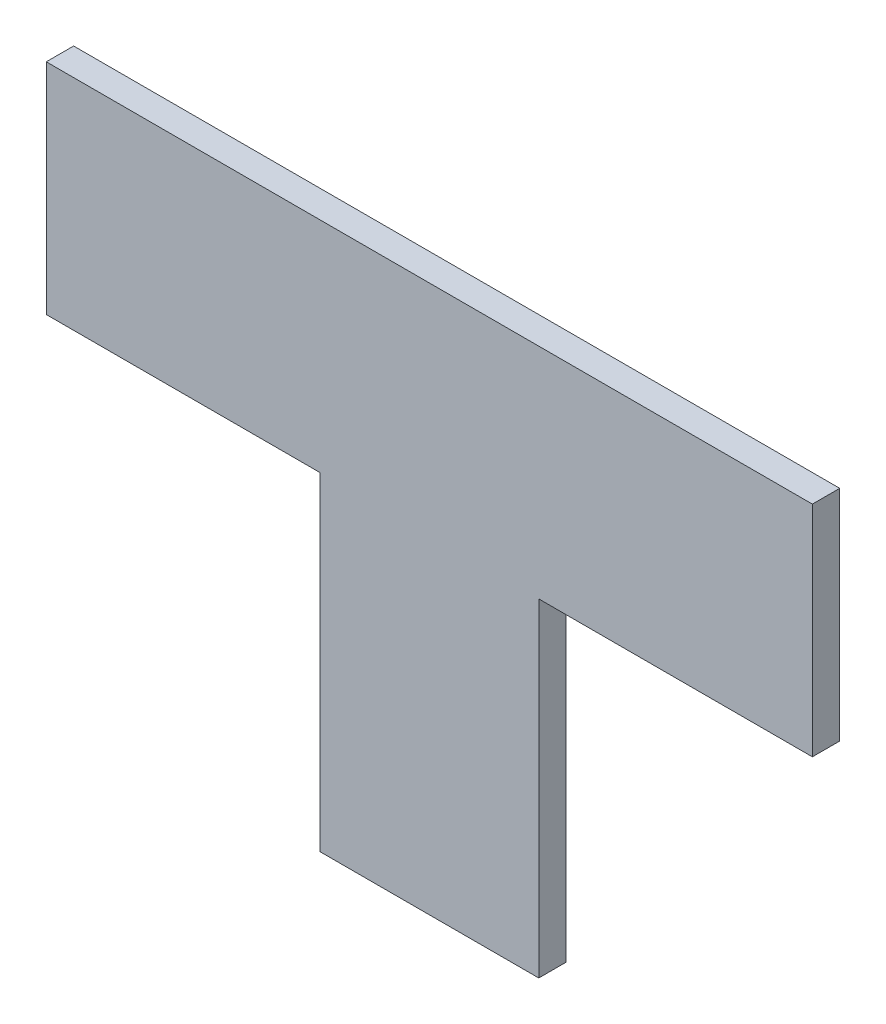
ISO-10303-21;
HEADER;
FILE_DESCRIPTION(('STEP AP214'),'2;1');
FILE_NAME('part.step','',(''),(''),'','','');
FILE_SCHEMA(('AUTOMOTIVE_DESIGN { 1 0 10303 214 1 1 1 1 }'));
ENDSEC;
DATA;
#1=APPLICATION_CONTEXT('core data for automotive mechanical design processes');
#2=APPLICATION_PROTOCOL_DEFINITION('international standard','automotive_design',2000,#1);
#3=PRODUCT_CONTEXT('',#1,'mechanical');
#4=PRODUCT('Part','Part','',(#3));
#5=PRODUCT_RELATED_PRODUCT_CATEGORY('part','',(#4));
#6=PRODUCT_DEFINITION_FORMATION('','',#4);
#7=PRODUCT_DEFINITION_CONTEXT('part definition',#1,'design');
#8=PRODUCT_DEFINITION('design','',#6,#7);
#9=PRODUCT_DEFINITION_SHAPE('','',#8);
#10=(LENGTH_UNIT() NAMED_UNIT(*) SI_UNIT(.MILLI.,.METRE.));
#11=(NAMED_UNIT(*) PLANE_ANGLE_UNIT() SI_UNIT($,.RADIAN.));
#12=(NAMED_UNIT(*) SI_UNIT($,.STERADIAN.) SOLID_ANGLE_UNIT());
#13=UNCERTAINTY_MEASURE_WITH_UNIT(LENGTH_MEASURE(1.E-05),#10,'distance_accuracy_value','');
#14=(GEOMETRIC_REPRESENTATION_CONTEXT(3) GLOBAL_UNCERTAINTY_ASSIGNED_CONTEXT((#13)) GLOBAL_UNIT_ASSIGNED_CONTEXT((#10,
#11,#12)) REPRESENTATION_CONTEXT('',''));
#15=CARTESIAN_POINT('',(0.,0.,0.));
#16=DIRECTION('',(0.,0.,1.));
#17=DIRECTION('',(1.,0.,0.));
#18=AXIS2_PLACEMENT_3D('',#15,#16,#17);
#19=CARTESIAN_POINT('',(25.4,0.,3.175));
#20=DIRECTION('',(0.,1.,0.));
#21=DIRECTION('',(0.,0.,1.));
#22=AXIS2_PLACEMENT_3D('',#19,#20,#21);
#23=PLANE('',#22);
#24=DIRECTION('',(1.,0.,0.));
#25=VECTOR('',#24,1.);
#26=CARTESIAN_POINT('',(25.4,0.,0.));
#27=LINE('',#26,#25);
#28=CARTESIAN_POINT('',(0.,0.,0.));
#29=VERTEX_POINT('',#28);
#30=CARTESIAN_POINT('',(25.4,0.,0.));
#31=VERTEX_POINT('',#30);
#32=EDGE_CURVE('E144',#29,#31,#27,.T.);
#33=ORIENTED_EDGE('',*,*,#32,.T.);
#34=DIRECTION('',(0.,0.,-1.));
#35=VECTOR('',#34,1.);
#36=CARTESIAN_POINT('',(25.4,0.,3.175));
#37=LINE('',#36,#35);
#38=CARTESIAN_POINT('',(25.4,0.,3.175));
#39=VERTEX_POINT('',#38);
#40=EDGE_CURVE('E11',#39,#31,#37,.T.);
#41=ORIENTED_EDGE('',*,*,#40,.F.);
#42=DIRECTION('',(1.,0.,0.));
#43=VECTOR('',#42,1.);
#44=CARTESIAN_POINT('',(25.4,0.,3.175));
#45=LINE('',#44,#43);
#46=CARTESIAN_POINT('',(0.,0.,3.175));
#47=VERTEX_POINT('',#46);
#48=EDGE_CURVE('E166',#47,#39,#45,.T.);
#49=ORIENTED_EDGE('',*,*,#48,.F.);
#50=DIRECTION('',(0.,0.,-1.));
#51=VECTOR('',#50,1.);
#52=CARTESIAN_POINT('',(0.,0.,3.175));
#53=LINE('',#52,#51);
#54=EDGE_CURVE('E140',#47,#29,#53,.T.);
#55=ORIENTED_EDGE('',*,*,#54,.T.);
#56=EDGE_LOOP('',(#33,#41,#49,#55));
#57=FACE_BOUND('',#56,.T.);
#58=ADVANCED_FACE('F43',(#57),#23,.F.);
#59=CARTESIAN_POINT('',(25.4,38.1,3.175));
#60=DIRECTION('',(-1.,0.,0.));
#61=DIRECTION('',(0.,-1.,0.));
#62=AXIS2_PLACEMENT_3D('',#59,#60,#61);
#63=PLANE('',#62);
#64=DIRECTION('',(0.,1.,0.));
#65=VECTOR('',#64,1.);
#66=CARTESIAN_POINT('',(25.4,38.1,0.));
#67=LINE('',#66,#65);
#68=CARTESIAN_POINT('',(25.4,38.1,0.));
#69=VERTEX_POINT('',#68);
#70=EDGE_CURVE('E148',#31,#69,#67,.T.);
#71=ORIENTED_EDGE('',*,*,#70,.T.);
#72=DIRECTION('',(0.,0.,-1.));
#73=VECTOR('',#72,1.);
#74=CARTESIAN_POINT('',(25.4,38.1,3.175));
#75=LINE('',#74,#73);
#76=CARTESIAN_POINT('',(25.4,38.1,3.175));
#77=VERTEX_POINT('',#76);
#78=EDGE_CURVE('E52',#77,#69,#75,.T.);
#79=ORIENTED_EDGE('',*,*,#78,.F.);
#80=DIRECTION('',(0.,1.,0.));
#81=VECTOR('',#80,1.);
#82=CARTESIAN_POINT('',(25.4,38.1,3.175));
#83=LINE('',#82,#81);
#84=EDGE_CURVE('E103',#39,#77,#83,.T.);
#85=ORIENTED_EDGE('',*,*,#84,.F.);
#86=ORIENTED_EDGE('',*,*,#40,.T.);
#87=EDGE_LOOP('',(#71,#79,#85,#86));
#88=FACE_BOUND('',#87,.T.);
#89=ADVANCED_FACE('F212',(#88),#63,.F.);
#90=CARTESIAN_POINT('',(57.15,38.1,3.175));
#91=DIRECTION('',(0.,1.,0.));
#92=DIRECTION('',(-1.,0.,0.));
#93=AXIS2_PLACEMENT_3D('',#90,#91,#92);
#94=PLANE('',#93);
#95=DIRECTION('',(1.,0.,0.));
#96=VECTOR('',#95,1.);
#97=CARTESIAN_POINT('',(57.15,38.1,0.));
#98=LINE('',#97,#96);
#99=CARTESIAN_POINT('',(57.15,38.1,0.));
#100=VERTEX_POINT('',#99);
#101=EDGE_CURVE('E151',#69,#100,#98,.T.);
#102=ORIENTED_EDGE('',*,*,#101,.T.);
#103=DIRECTION('',(0.,0.,-1.));
#104=VECTOR('',#103,1.);
#105=CARTESIAN_POINT('',(57.15,38.1,3.175));
#106=LINE('',#105,#104);
#107=CARTESIAN_POINT('',(57.15,38.1,3.175));
#108=VERTEX_POINT('',#107);
#109=EDGE_CURVE('E177',#108,#100,#106,.T.);
#110=ORIENTED_EDGE('',*,*,#109,.F.);
#111=DIRECTION('',(1.,0.,0.));
#112=VECTOR('',#111,1.);
#113=CARTESIAN_POINT('',(57.15,38.1,3.175));
#114=LINE('',#113,#112);
#115=EDGE_CURVE('E187',#77,#108,#114,.T.);
#116=ORIENTED_EDGE('',*,*,#115,.F.);
#117=ORIENTED_EDGE('',*,*,#78,.T.);
#118=EDGE_LOOP('',(#102,#110,#116,#117));
#119=FACE_BOUND('',#118,.T.);
#120=ADVANCED_FACE('F185',(#119),#94,.F.);
#121=CARTESIAN_POINT('',(57.15,63.5,3.175));
#122=DIRECTION('',(-1.,0.,0.));
#123=DIRECTION('',(0.,-1.,0.));
#124=AXIS2_PLACEMENT_3D('',#121,#122,#123);
#125=PLANE('',#124);
#126=DIRECTION('',(0.,1.,0.));
#127=VECTOR('',#126,1.);
#128=CARTESIAN_POINT('',(57.15,63.5,0.));
#129=LINE('',#128,#127);
#130=CARTESIAN_POINT('',(57.15,63.5,0.));
#131=VERTEX_POINT('',#130);
#132=EDGE_CURVE('E154',#100,#131,#129,.T.);
#133=ORIENTED_EDGE('',*,*,#132,.T.);
#134=DIRECTION('',(0.,0.,-1.));
#135=VECTOR('',#134,1.);
#136=CARTESIAN_POINT('',(57.15,63.5,3.175));
#137=LINE('',#136,#135);
#138=CARTESIAN_POINT('',(57.15,63.5,3.175));
#139=VERTEX_POINT('',#138);
#140=EDGE_CURVE('E173',#139,#131,#137,.T.);
#141=ORIENTED_EDGE('',*,*,#140,.F.);
#142=DIRECTION('',(0.,1.,0.));
#143=VECTOR('',#142,1.);
#144=CARTESIAN_POINT('',(57.15,63.5,3.175));
#145=LINE('',#144,#143);
#146=EDGE_CURVE('E200',#108,#139,#145,.T.);
#147=ORIENTED_EDGE('',*,*,#146,.F.);
#148=ORIENTED_EDGE('',*,*,#109,.T.);
#149=EDGE_LOOP('',(#133,#141,#147,#148));
#150=FACE_BOUND('',#149,.T.);
#151=ADVANCED_FACE('F195',(#150),#125,.F.);
#152=CARTESIAN_POINT('',(-31.75,63.5,3.175));
#153=DIRECTION('',(0.,-1.,0.));
#154=DIRECTION('',(1.,0.,0.));
#155=AXIS2_PLACEMENT_3D('',#152,#153,#154);
#156=PLANE('',#155);
#157=DIRECTION('',(-1.,0.,0.));
#158=VECTOR('',#157,1.);
#159=CARTESIAN_POINT('',(-31.75,63.5,0.));
#160=LINE('',#159,#158);
#161=CARTESIAN_POINT('',(-31.75,63.5,0.));
#162=VERTEX_POINT('',#161);
#163=EDGE_CURVE('E157',#131,#162,#160,.T.);
#164=ORIENTED_EDGE('',*,*,#163,.T.);
#165=DIRECTION('',(0.,0.,-1.));
#166=VECTOR('',#165,1.);
#167=CARTESIAN_POINT('',(-31.75,63.5,3.175));
#168=LINE('',#167,#166);
#169=CARTESIAN_POINT('',(-31.75,63.5,3.175));
#170=VERTEX_POINT('',#169);
#171=EDGE_CURVE('E133',#170,#162,#168,.T.);
#172=ORIENTED_EDGE('',*,*,#171,.F.);
#173=DIRECTION('',(-1.,0.,0.));
#174=VECTOR('',#173,1.);
#175=CARTESIAN_POINT('',(-31.75,63.5,3.175));
#176=LINE('',#175,#174);
#177=EDGE_CURVE('E122',#139,#170,#176,.T.);
#178=ORIENTED_EDGE('',*,*,#177,.F.);
#179=ORIENTED_EDGE('',*,*,#140,.T.);
#180=EDGE_LOOP('',(#164,#172,#178,#179));
#181=FACE_BOUND('',#180,.T.);
#182=ADVANCED_FACE('F198',(#181),#156,.F.);
#183=CARTESIAN_POINT('',(-31.75,38.1,3.175));
#184=DIRECTION('',(1.,0.,0.));
#185=DIRECTION('',(0.,1.,0.));
#186=AXIS2_PLACEMENT_3D('',#183,#184,#185);
#187=PLANE('',#186);
#188=DIRECTION('',(0.,-1.,0.));
#189=VECTOR('',#188,1.);
#190=CARTESIAN_POINT('',(-31.75,38.1,0.));
#191=LINE('',#190,#189);
#192=CARTESIAN_POINT('',(-31.75,38.1,0.));
#193=VERTEX_POINT('',#192);
#194=EDGE_CURVE('E131',#162,#193,#191,.T.);
#195=ORIENTED_EDGE('',*,*,#194,.T.);
#196=DIRECTION('',(0.,0.,-1.));
#197=VECTOR('',#196,1.);
#198=CARTESIAN_POINT('',(-31.75,38.1,3.175));
#199=LINE('',#198,#197);
#200=CARTESIAN_POINT('',(-31.75,38.1,3.175));
#201=VERTEX_POINT('',#200);
#202=EDGE_CURVE('E128',#201,#193,#199,.T.);
#203=ORIENTED_EDGE('',*,*,#202,.F.);
#204=DIRECTION('',(0.,-1.,0.));
#205=VECTOR('',#204,1.);
#206=CARTESIAN_POINT('',(-31.75,38.1,3.175));
#207=LINE('',#206,#205);
#208=EDGE_CURVE('E116',#170,#201,#207,.T.);
#209=ORIENTED_EDGE('',*,*,#208,.F.);
#210=ORIENTED_EDGE('',*,*,#171,.T.);
#211=EDGE_LOOP('',(#195,#203,#209,#210));
#212=FACE_BOUND('',#211,.T.);
#213=ADVANCED_FACE('F129',(#212),#187,.F.);
#214=CARTESIAN_POINT('',(0.,38.1,3.175));
#215=DIRECTION('',(0.,1.,0.));
#216=DIRECTION('',(-1.,0.,0.));
#217=AXIS2_PLACEMENT_3D('',#214,#215,#216);
#218=PLANE('',#217);
#219=DIRECTION('',(1.,0.,0.));
#220=VECTOR('',#219,1.);
#221=CARTESIAN_POINT('',(0.,38.1,0.));
#222=LINE('',#221,#220);
#223=CARTESIAN_POINT('',(0.,38.1,0.));
#224=VERTEX_POINT('',#223);
#225=EDGE_CURVE('E89',#193,#224,#222,.T.);
#226=ORIENTED_EDGE('',*,*,#225,.T.);
#227=DIRECTION('',(0.,0.,-1.));
#228=VECTOR('',#227,1.);
#229=CARTESIAN_POINT('',(0.,38.1,3.175));
#230=LINE('',#229,#228);
#231=CARTESIAN_POINT('',(0.,38.1,3.175));
#232=VERTEX_POINT('',#231);
#233=EDGE_CURVE('E134',#232,#224,#230,.T.);
#234=ORIENTED_EDGE('',*,*,#233,.F.);
#235=DIRECTION('',(1.,0.,0.));
#236=VECTOR('',#235,1.);
#237=CARTESIAN_POINT('',(0.,38.1,3.175));
#238=LINE('',#237,#236);
#239=EDGE_CURVE('E120',#201,#232,#238,.T.);
#240=ORIENTED_EDGE('',*,*,#239,.F.);
#241=ORIENTED_EDGE('',*,*,#202,.T.);
#242=EDGE_LOOP('',(#226,#234,#240,#241));
#243=FACE_BOUND('',#242,.T.);
#244=ADVANCED_FACE('F136',(#243),#218,.F.);
#245=CARTESIAN_POINT('',(0.,0.,3.175));
#246=DIRECTION('',(1.,0.,0.));
#247=DIRECTION('',(0.,0.,-1.));
#248=AXIS2_PLACEMENT_3D('',#245,#246,#247);
#249=PLANE('',#248);
#250=DIRECTION('',(0.,-1.,0.));
#251=VECTOR('',#250,1.);
#252=CARTESIAN_POINT('',(0.,0.,0.));
#253=LINE('',#252,#251);
#254=EDGE_CURVE('E95',#224,#29,#253,.T.);
#255=ORIENTED_EDGE('',*,*,#254,.T.);
#256=ORIENTED_EDGE('',*,*,#54,.F.);
#257=DIRECTION('',(0.,-1.,0.));
#258=VECTOR('',#257,1.);
#259=CARTESIAN_POINT('',(0.,0.,3.175));
#260=LINE('',#259,#258);
#261=EDGE_CURVE('E60',#232,#47,#260,.T.);
#262=ORIENTED_EDGE('',*,*,#261,.F.);
#263=ORIENTED_EDGE('',*,*,#233,.T.);
#264=EDGE_LOOP('',(#255,#256,#262,#263));
#265=FACE_BOUND('',#264,.T.);
#266=ADVANCED_FACE('F228',(#265),#249,.F.);
#267=CARTESIAN_POINT('',(0.,0.,3.175));
#268=DIRECTION('',(0.,0.,-1.));
#269=DIRECTION('',(-1.,0.,0.));
#270=AXIS2_PLACEMENT_3D('',#267,#268,#269);
#271=PLANE('',#270);
#272=ORIENTED_EDGE('',*,*,#48,.T.);
#273=ORIENTED_EDGE('',*,*,#84,.T.);
#274=ORIENTED_EDGE('',*,*,#115,.T.);
#275=ORIENTED_EDGE('',*,*,#146,.T.);
#276=ORIENTED_EDGE('',*,*,#177,.T.);
#277=ORIENTED_EDGE('',*,*,#208,.T.);
#278=ORIENTED_EDGE('',*,*,#239,.T.);
#279=ORIENTED_EDGE('',*,*,#261,.T.);
#280=EDGE_LOOP('',(#272,#273,#274,#275,#276,#277,#278,#279));
#281=FACE_BOUND('',#280,.T.);
#282=ADVANCED_FACE('F118',(#281),#271,.F.);
#283=CARTESIAN_POINT('',(0.,0.,0.));
#284=DIRECTION('',(0.,0.,-1.));
#285=DIRECTION('',(-1.,0.,0.));
#286=AXIS2_PLACEMENT_3D('',#283,#284,#285);
#287=PLANE('',#286);
#288=ORIENTED_EDGE('',*,*,#32,.F.);
#289=ORIENTED_EDGE('',*,*,#254,.F.);
#290=ORIENTED_EDGE('',*,*,#225,.F.);
#291=ORIENTED_EDGE('',*,*,#194,.F.);
#292=ORIENTED_EDGE('',*,*,#163,.F.);
#293=ORIENTED_EDGE('',*,*,#132,.F.);
#294=ORIENTED_EDGE('',*,*,#101,.F.);
#295=ORIENTED_EDGE('',*,*,#70,.F.);
#296=EDGE_LOOP('',(#288,#289,#290,#291,#292,#293,#294,#295));
#297=FACE_BOUND('',#296,.T.);
#298=ADVANCED_FACE('F191',(#297),#287,.T.);
#299=CLOSED_SHELL('',(#58,#89,#120,#151,#182,#213,#244,#266,#282,#298));
#300=MANIFOLD_SOLID_BREP('B2',#299);
#301=ADVANCED_BREP_SHAPE_REPRESENTATION('',(#18,#300),#14);
#302=SHAPE_DEFINITION_REPRESENTATION(#9,#301);
ENDSEC;
END-ISO-10303-21;
